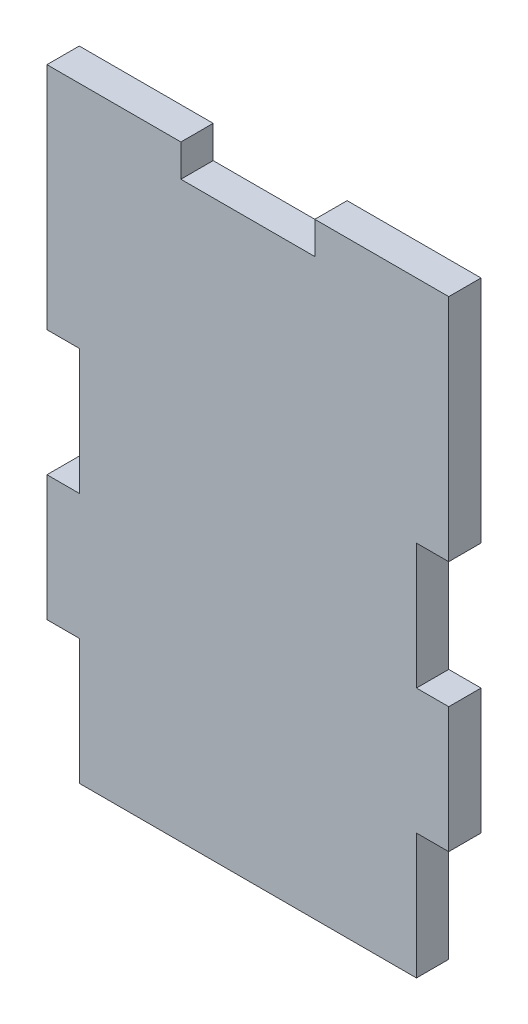
ISO-10303-21;
HEADER;
FILE_DESCRIPTION(('STEP AP214'),'2;1');
FILE_NAME('part.step','',(''),(''),'','','');
FILE_SCHEMA(('AUTOMOTIVE_DESIGN { 1 0 10303 214 1 1 1 1 }'));
ENDSEC;
DATA;
#1=APPLICATION_CONTEXT('core data for automotive mechanical design processes');
#2=APPLICATION_PROTOCOL_DEFINITION('international standard','automotive_design',2000,#1);
#3=PRODUCT_CONTEXT('',#1,'mechanical');
#4=PRODUCT('Part','Part','',(#3));
#5=PRODUCT_RELATED_PRODUCT_CATEGORY('part','',(#4));
#6=PRODUCT_DEFINITION_FORMATION('','',#4);
#7=PRODUCT_DEFINITION_CONTEXT('part definition',#1,'design');
#8=PRODUCT_DEFINITION('design','',#6,#7);
#9=PRODUCT_DEFINITION_SHAPE('','',#8);
#10=(LENGTH_UNIT() NAMED_UNIT(*) SI_UNIT(.MILLI.,.METRE.));
#11=(NAMED_UNIT(*) PLANE_ANGLE_UNIT() SI_UNIT($,.RADIAN.));
#12=(NAMED_UNIT(*) SI_UNIT($,.STERADIAN.) SOLID_ANGLE_UNIT());
#13=UNCERTAINTY_MEASURE_WITH_UNIT(LENGTH_MEASURE(1.E-05),#10,'distance_accuracy_value','');
#14=(GEOMETRIC_REPRESENTATION_CONTEXT(3) GLOBAL_UNCERTAINTY_ASSIGNED_CONTEXT((#13)) GLOBAL_UNIT_ASSIGNED_CONTEXT((#10,
#11,#12)) REPRESENTATION_CONTEXT('',''));
#15=CARTESIAN_POINT('',(0.,0.,0.));
#16=DIRECTION('',(0.,0.,1.));
#17=DIRECTION('',(1.,0.,0.));
#18=AXIS2_PLACEMENT_3D('',#15,#16,#17);
#19=CARTESIAN_POINT('',(0.,26.25,2.25));
#20=DIRECTION('',(0.,1.,0.));
#21=DIRECTION('',(0.,0.,1.));
#22=AXIS2_PLACEMENT_3D('',#19,#20,#21);
#23=PLANE('',#22);
#24=DIRECTION('',(1.,0.,0.));
#25=VECTOR('',#24,1.);
#26=CARTESIAN_POINT('',(0.,26.25,0.));
#27=LINE('',#26,#25);
#28=CARTESIAN_POINT('',(23.5,26.25,0.));
#29=VERTEX_POINT('',#28);
#30=CARTESIAN_POINT('',(25.75,26.25,0.));
#31=VERTEX_POINT('',#30);
#32=EDGE_CURVE('E206',#29,#31,#27,.T.);
#33=ORIENTED_EDGE('',*,*,#32,.T.);
#34=DIRECTION('',(0.,0.,-1.));
#35=VECTOR('',#34,1.);
#36=CARTESIAN_POINT('',(25.75,26.25,2.25));
#37=LINE('',#36,#35);
#38=CARTESIAN_POINT('',(25.75,26.25,2.25));
#39=VERTEX_POINT('',#38);
#40=EDGE_CURVE('E11',#39,#31,#37,.T.);
#41=ORIENTED_EDGE('',*,*,#40,.F.);
#42=DIRECTION('',(1.,0.,0.));
#43=VECTOR('',#42,1.);
#44=CARTESIAN_POINT('',(0.,26.25,2.25));
#45=LINE('',#44,#43);
#46=CARTESIAN_POINT('',(23.5,26.25,2.25));
#47=VERTEX_POINT('',#46);
#48=EDGE_CURVE('E347',#47,#39,#45,.T.);
#49=ORIENTED_EDGE('',*,*,#48,.F.);
#50=DIRECTION('',(0.,0.,-1.));
#51=VECTOR('',#50,1.);
#52=CARTESIAN_POINT('',(23.5,26.25,2.25));
#53=LINE('',#52,#51);
#54=EDGE_CURVE('E254',#47,#29,#53,.T.);
#55=ORIENTED_EDGE('',*,*,#54,.T.);
#56=EDGE_LOOP('',(#33,#41,#49,#55));
#57=FACE_BOUND('',#56,.T.);
#58=ADVANCED_FACE('F39',(#57),#23,.F.);
#59=CARTESIAN_POINT('',(25.7499999999999,0.,2.25));
#60=DIRECTION('',(-1.,0.,0.));
#61=DIRECTION('',(0.,-1.,0.));
#62=AXIS2_PLACEMENT_3D('',#59,#60,#61);
#63=PLANE('',#62);
#64=DIRECTION('',(0.,1.,0.));
#65=VECTOR('',#64,1.);
#66=CARTESIAN_POINT('',(25.7499999999999,0.,0.));
#67=LINE('',#66,#65);
#68=CARTESIAN_POINT('',(25.75,42.25,0.));
#69=VERTEX_POINT('',#68);
#70=EDGE_CURVE('E209',#31,#69,#67,.T.);
#71=ORIENTED_EDGE('',*,*,#70,.T.);
#72=DIRECTION('',(0.,0.,-1.));
#73=VECTOR('',#72,1.);
#74=CARTESIAN_POINT('',(25.75,42.25,2.25));
#75=LINE('',#74,#73);
#76=CARTESIAN_POINT('',(25.75,42.25,2.25));
#77=VERTEX_POINT('',#76);
#78=EDGE_CURVE('E47',#77,#69,#75,.T.);
#79=ORIENTED_EDGE('',*,*,#78,.F.);
#80=DIRECTION('',(0.,1.,0.));
#81=VECTOR('',#80,1.);
#82=CARTESIAN_POINT('',(25.7499999999999,0.,2.25));
#83=LINE('',#82,#81);
#84=EDGE_CURVE('E133',#39,#77,#83,.T.);
#85=ORIENTED_EDGE('',*,*,#84,.F.);
#86=ORIENTED_EDGE('',*,*,#40,.T.);
#87=EDGE_LOOP('',(#71,#79,#85,#86));
#88=FACE_BOUND('',#87,.T.);
#89=ADVANCED_FACE('F352',(#88),#63,.F.);
#90=CARTESIAN_POINT('',(0.,42.25,2.25));
#91=DIRECTION('',(0.,-1.,0.));
#92=DIRECTION('',(0.,0.,-1.));
#93=AXIS2_PLACEMENT_3D('',#90,#91,#92);
#94=PLANE('',#93);
#95=DIRECTION('',(-1.,0.,0.));
#96=VECTOR('',#95,1.);
#97=CARTESIAN_POINT('',(0.,42.25,0.));
#98=LINE('',#97,#96);
#99=CARTESIAN_POINT('',(16.4166666666667,42.25,0.));
#100=VERTEX_POINT('',#99);
#101=EDGE_CURVE('E211',#69,#100,#98,.T.);
#102=ORIENTED_EDGE('',*,*,#101,.T.);
#103=DIRECTION('',(0.,0.,-1.));
#104=VECTOR('',#103,1.);
#105=CARTESIAN_POINT('',(16.4166666666667,42.25,2.25));
#106=LINE('',#105,#104);
#107=CARTESIAN_POINT('',(16.4166666666667,42.25,2.25));
#108=VERTEX_POINT('',#107);
#109=EDGE_CURVE('E286',#108,#100,#106,.T.);
#110=ORIENTED_EDGE('',*,*,#109,.F.);
#111=DIRECTION('',(-1.,0.,0.));
#112=VECTOR('',#111,1.);
#113=CARTESIAN_POINT('',(0.,42.25,2.25));
#114=LINE('',#113,#112);
#115=EDGE_CURVE('E293',#77,#108,#114,.T.);
#116=ORIENTED_EDGE('',*,*,#115,.F.);
#117=ORIENTED_EDGE('',*,*,#78,.T.);
#118=EDGE_LOOP('',(#102,#110,#116,#117));
#119=FACE_BOUND('',#118,.T.);
#120=ADVANCED_FACE('F291',(#119),#94,.F.);
#121=CARTESIAN_POINT('',(16.4166666666667,0.,2.25));
#122=DIRECTION('',(-1.,0.,0.));
#123=DIRECTION('',(0.,0.,1.));
#124=AXIS2_PLACEMENT_3D('',#121,#122,#123);
#125=PLANE('',#124);
#126=DIRECTION('',(0.,1.,0.));
#127=VECTOR('',#126,1.);
#128=CARTESIAN_POINT('',(16.4166666666667,0.,0.));
#129=LINE('',#128,#127);
#130=CARTESIAN_POINT('',(16.4166666666667,40.,0.));
#131=VERTEX_POINT('',#130);
#132=EDGE_CURVE('E214',#131,#100,#129,.T.);
#133=ORIENTED_EDGE('',*,*,#132,.F.);
#134=DIRECTION('',(0.,0.,-1.));
#135=VECTOR('',#134,1.);
#136=CARTESIAN_POINT('',(16.4166666666667,40.,2.25));
#137=LINE('',#136,#135);
#138=CARTESIAN_POINT('',(16.4166666666667,40.,2.25));
#139=VERTEX_POINT('',#138);
#140=EDGE_CURVE('E284',#139,#131,#137,.T.);
#141=ORIENTED_EDGE('',*,*,#140,.F.);
#142=DIRECTION('',(0.,1.,0.));
#143=VECTOR('',#142,1.);
#144=CARTESIAN_POINT('',(16.4166666666667,0.,2.25));
#145=LINE('',#144,#143);
#146=EDGE_CURVE('E304',#139,#108,#145,.T.);
#147=ORIENTED_EDGE('',*,*,#146,.T.);
#148=ORIENTED_EDGE('',*,*,#109,.T.);
#149=EDGE_LOOP('',(#133,#141,#147,#148));
#150=FACE_BOUND('',#149,.T.);
#151=ADVANCED_FACE('F301',(#150),#125,.T.);
#152=CARTESIAN_POINT('',(0.,40.,2.25));
#153=DIRECTION('',(0.,1.,0.));
#154=DIRECTION('',(0.,0.,1.));
#155=AXIS2_PLACEMENT_3D('',#152,#153,#154);
#156=PLANE('',#155);
#157=DIRECTION('',(1.,0.,0.));
#158=VECTOR('',#157,1.);
#159=CARTESIAN_POINT('',(0.,40.,0.));
#160=LINE('',#159,#158);
#161=CARTESIAN_POINT('',(7.08333333333333,40.,0.));
#162=VERTEX_POINT('',#161);
#163=EDGE_CURVE('E217',#162,#131,#160,.T.);
#164=ORIENTED_EDGE('',*,*,#163,.F.);
#165=DIRECTION('',(0.,0.,-1.));
#166=VECTOR('',#165,1.);
#167=CARTESIAN_POINT('',(7.08333333333333,40.,2.25));
#168=LINE('',#167,#166);
#169=CARTESIAN_POINT('',(7.08333333333333,40.,2.25));
#170=VERTEX_POINT('',#169);
#171=EDGE_CURVE('E282',#170,#162,#168,.T.);
#172=ORIENTED_EDGE('',*,*,#171,.F.);
#173=DIRECTION('',(1.,0.,0.));
#174=VECTOR('',#173,1.);
#175=CARTESIAN_POINT('',(0.,40.,2.25));
#176=LINE('',#175,#174);
#177=EDGE_CURVE('E307',#170,#139,#176,.T.);
#178=ORIENTED_EDGE('',*,*,#177,.T.);
#179=ORIENTED_EDGE('',*,*,#140,.T.);
#180=EDGE_LOOP('',(#164,#172,#178,#179));
#181=FACE_BOUND('',#180,.T.);
#182=ADVANCED_FACE('F362',(#181),#156,.T.);
#183=CARTESIAN_POINT('',(7.08333333333331,0.,2.25));
#184=DIRECTION('',(-1.,0.,0.));
#185=DIRECTION('',(0.,-1.,0.));
#186=AXIS2_PLACEMENT_3D('',#183,#184,#185);
#187=PLANE('',#186);
#188=DIRECTION('',(0.,1.,0.));
#189=VECTOR('',#188,1.);
#190=CARTESIAN_POINT('',(7.08333333333331,0.,0.));
#191=LINE('',#190,#189);
#192=CARTESIAN_POINT('',(7.08333333333333,42.25,0.));
#193=VERTEX_POINT('',#192);
#194=EDGE_CURVE('E220',#162,#193,#191,.T.);
#195=ORIENTED_EDGE('',*,*,#194,.T.);
#196=DIRECTION('',(0.,0.,-1.));
#197=VECTOR('',#196,1.);
#198=CARTESIAN_POINT('',(7.08333333333333,42.25,2.25));
#199=LINE('',#198,#197);
#200=CARTESIAN_POINT('',(7.08333333333333,42.25,2.25));
#201=VERTEX_POINT('',#200);
#202=EDGE_CURVE('E280',#201,#193,#199,.T.);
#203=ORIENTED_EDGE('',*,*,#202,.F.);
#204=DIRECTION('',(0.,1.,0.));
#205=VECTOR('',#204,1.);
#206=CARTESIAN_POINT('',(7.08333333333331,0.,2.25));
#207=LINE('',#206,#205);
#208=EDGE_CURVE('E309',#170,#201,#207,.T.);
#209=ORIENTED_EDGE('',*,*,#208,.F.);
#210=ORIENTED_EDGE('',*,*,#171,.T.);
#211=EDGE_LOOP('',(#195,#203,#209,#210));
#212=FACE_BOUND('',#211,.T.);
#213=ADVANCED_FACE('F365',(#212),#187,.F.);
#214=CARTESIAN_POINT('',(0.,42.25,2.25));
#215=DIRECTION('',(0.,1.,0.));
#216=DIRECTION('',(0.,0.,1.));
#217=AXIS2_PLACEMENT_3D('',#214,#215,#216);
#218=PLANE('',#217);
#219=DIRECTION('',(1.,0.,0.));
#220=VECTOR('',#219,1.);
#221=CARTESIAN_POINT('',(0.,42.25,0.));
#222=LINE('',#221,#220);
#223=CARTESIAN_POINT('',(-2.25,42.25,0.));
#224=VERTEX_POINT('',#223);
#225=EDGE_CURVE('E223',#224,#193,#222,.T.);
#226=ORIENTED_EDGE('',*,*,#225,.F.);
#227=DIRECTION('',(0.,0.,-1.));
#228=VECTOR('',#227,1.);
#229=CARTESIAN_POINT('',(-2.25,42.25,2.25));
#230=LINE('',#229,#228);
#231=CARTESIAN_POINT('',(-2.25,42.25,2.25));
#232=VERTEX_POINT('',#231);
#233=EDGE_CURVE('E278',#232,#224,#230,.T.);
#234=ORIENTED_EDGE('',*,*,#233,.F.);
#235=DIRECTION('',(1.,0.,0.));
#236=VECTOR('',#235,1.);
#237=CARTESIAN_POINT('',(0.,42.25,2.25));
#238=LINE('',#237,#236);
#239=EDGE_CURVE('E315',#232,#201,#238,.T.);
#240=ORIENTED_EDGE('',*,*,#239,.T.);
#241=ORIENTED_EDGE('',*,*,#202,.T.);
#242=EDGE_LOOP('',(#226,#234,#240,#241));
#243=FACE_BOUND('',#242,.T.);
#244=ADVANCED_FACE('F369',(#243),#218,.T.);
#245=CARTESIAN_POINT('',(-2.24999999999995,0.,2.25));
#246=DIRECTION('',(-1.,0.,0.));
#247=DIRECTION('',(0.,-1.,0.));
#248=AXIS2_PLACEMENT_3D('',#245,#246,#247);
#249=PLANE('',#248);
#250=DIRECTION('',(0.,1.,0.));
#251=VECTOR('',#250,1.);
#252=CARTESIAN_POINT('',(-2.24999999999995,0.,0.));
#253=LINE('',#252,#251);
#254=CARTESIAN_POINT('',(-2.25,26.25,0.));
#255=VERTEX_POINT('',#254);
#256=EDGE_CURVE('E226',#255,#224,#253,.T.);
#257=ORIENTED_EDGE('',*,*,#256,.F.);
#258=DIRECTION('',(0.,0.,-1.));
#259=VECTOR('',#258,1.);
#260=CARTESIAN_POINT('',(-2.25,26.25,2.25));
#261=LINE('',#260,#259);
#262=CARTESIAN_POINT('',(-2.25,26.25,2.25));
#263=VERTEX_POINT('',#262);
#264=EDGE_CURVE('E276',#263,#255,#261,.T.);
#265=ORIENTED_EDGE('',*,*,#264,.F.);
#266=DIRECTION('',(0.,1.,0.));
#267=VECTOR('',#266,1.);
#268=CARTESIAN_POINT('',(-2.24999999999995,0.,2.25));
#269=LINE('',#268,#267);
#270=EDGE_CURVE('E318',#263,#232,#269,.T.);
#271=ORIENTED_EDGE('',*,*,#270,.T.);
#272=ORIENTED_EDGE('',*,*,#233,.T.);
#273=EDGE_LOOP('',(#257,#265,#271,#272));
#274=FACE_BOUND('',#273,.T.);
#275=ADVANCED_FACE('F373',(#274),#249,.T.);
#276=CARTESIAN_POINT('',(0.,26.25,2.25));
#277=DIRECTION('',(0.,-1.,0.));
#278=DIRECTION('',(0.,0.,-1.));
#279=AXIS2_PLACEMENT_3D('',#276,#277,#278);
#280=PLANE('',#279);
#281=DIRECTION('',(-1.,0.,0.));
#282=VECTOR('',#281,1.);
#283=CARTESIAN_POINT('',(0.,26.25,0.));
#284=LINE('',#283,#282);
#285=CARTESIAN_POINT('',(0.,26.25,0.));
#286=VERTEX_POINT('',#285);
#287=EDGE_CURVE('E229',#286,#255,#284,.T.);
#288=ORIENTED_EDGE('',*,*,#287,.F.);
#289=DIRECTION('',(0.,0.,-1.));
#290=VECTOR('',#289,1.);
#291=CARTESIAN_POINT('',(0.,26.25,2.25));
#292=LINE('',#291,#290);
#293=CARTESIAN_POINT('',(0.,26.25,2.25));
#294=VERTEX_POINT('',#293);
#295=EDGE_CURVE('E274',#294,#286,#292,.T.);
#296=ORIENTED_EDGE('',*,*,#295,.F.);
#297=DIRECTION('',(-1.,0.,0.));
#298=VECTOR('',#297,1.);
#299=CARTESIAN_POINT('',(0.,26.25,2.25));
#300=LINE('',#299,#298);
#301=EDGE_CURVE('E321',#294,#263,#300,.T.);
#302=ORIENTED_EDGE('',*,*,#301,.T.);
#303=ORIENTED_EDGE('',*,*,#264,.T.);
#304=EDGE_LOOP('',(#288,#296,#302,#303));
#305=FACE_BOUND('',#304,.T.);
#306=ADVANCED_FACE('F377',(#305),#280,.T.);
#307=CARTESIAN_POINT('',(0.,0.,2.25));
#308=DIRECTION('',(-1.,0.,0.));
#309=DIRECTION('',(0.,-1.,0.));
#310=AXIS2_PLACEMENT_3D('',#307,#308,#309);
#311=PLANE('',#310);
#312=DIRECTION('',(0.,1.,0.));
#313=VECTOR('',#312,1.);
#314=CARTESIAN_POINT('',(0.,0.,0.));
#315=LINE('',#314,#313);
#316=CARTESIAN_POINT('',(0.,17.5,0.));
#317=VERTEX_POINT('',#316);
#318=EDGE_CURVE('E232',#317,#286,#315,.T.);
#319=ORIENTED_EDGE('',*,*,#318,.F.);
#320=DIRECTION('',(0.,0.,-1.));
#321=VECTOR('',#320,1.);
#322=CARTESIAN_POINT('',(0.,17.5,2.25));
#323=LINE('',#322,#321);
#324=CARTESIAN_POINT('',(0.,17.5,2.25));
#325=VERTEX_POINT('',#324);
#326=EDGE_CURVE('E272',#325,#317,#323,.T.);
#327=ORIENTED_EDGE('',*,*,#326,.F.);
#328=DIRECTION('',(0.,1.,0.));
#329=VECTOR('',#328,1.);
#330=CARTESIAN_POINT('',(0.,0.,2.25));
#331=LINE('',#330,#329);
#332=EDGE_CURVE('E324',#325,#294,#331,.T.);
#333=ORIENTED_EDGE('',*,*,#332,.T.);
#334=ORIENTED_EDGE('',*,*,#295,.T.);
#335=EDGE_LOOP('',(#319,#327,#333,#334));
#336=FACE_BOUND('',#335,.T.);
#337=ADVANCED_FACE('F381',(#336),#311,.T.);
#338=CARTESIAN_POINT('',(0.,17.5,2.25));
#339=DIRECTION('',(0.,1.,0.));
#340=DIRECTION('',(-1.,0.,0.));
#341=AXIS2_PLACEMENT_3D('',#338,#339,#340);
#342=PLANE('',#341);
#343=DIRECTION('',(1.,0.,0.));
#344=VECTOR('',#343,1.);
#345=CARTESIAN_POINT('',(0.,17.5,0.));
#346=LINE('',#345,#344);
#347=CARTESIAN_POINT('',(-2.25000000000001,17.5,0.));
#348=VERTEX_POINT('',#347);
#349=EDGE_CURVE('E235',#348,#317,#346,.T.);
#350=ORIENTED_EDGE('',*,*,#349,.F.);
#351=DIRECTION('',(0.,0.,-1.));
#352=VECTOR('',#351,1.);
#353=CARTESIAN_POINT('',(-2.25000000000001,17.5,2.25));
#354=LINE('',#353,#352);
#355=CARTESIAN_POINT('',(-2.25000000000001,17.5,2.25));
#356=VERTEX_POINT('',#355);
#357=EDGE_CURVE('E270',#356,#348,#354,.T.);
#358=ORIENTED_EDGE('',*,*,#357,.F.);
#359=DIRECTION('',(1.,0.,0.));
#360=VECTOR('',#359,1.);
#361=CARTESIAN_POINT('',(0.,17.5,2.25));
#362=LINE('',#361,#360);
#363=EDGE_CURVE('E327',#356,#325,#362,.T.);
#364=ORIENTED_EDGE('',*,*,#363,.T.);
#365=ORIENTED_EDGE('',*,*,#326,.T.);
#366=EDGE_LOOP('',(#350,#358,#364,#365));
#367=FACE_BOUND('',#366,.T.);
#368=ADVANCED_FACE('F383',(#367),#342,.T.);
#369=CARTESIAN_POINT('',(-2.25000000000001,0.,2.25));
#370=DIRECTION('',(1.,0.,0.));
#371=DIRECTION('',(0.,0.,-1.));
#372=AXIS2_PLACEMENT_3D('',#369,#370,#371);
#373=PLANE('',#372);
#374=DIRECTION('',(0.,-1.,0.));
#375=VECTOR('',#374,1.);
#376=CARTESIAN_POINT('',(-2.25000000000001,0.,0.));
#377=LINE('',#376,#375);
#378=CARTESIAN_POINT('',(-2.25000000000001,8.75,0.));
#379=VERTEX_POINT('',#378);
#380=EDGE_CURVE('E239',#348,#379,#377,.T.);
#381=ORIENTED_EDGE('',*,*,#380,.T.);
#382=DIRECTION('',(0.,0.,-1.));
#383=VECTOR('',#382,1.);
#384=CARTESIAN_POINT('',(-2.25000000000001,8.75,2.25));
#385=LINE('',#384,#383);
#386=CARTESIAN_POINT('',(-2.25000000000001,8.75,2.25));
#387=VERTEX_POINT('',#386);
#388=EDGE_CURVE('E267',#387,#379,#385,.T.);
#389=ORIENTED_EDGE('',*,*,#388,.F.);
#390=DIRECTION('',(0.,-1.,0.));
#391=VECTOR('',#390,1.);
#392=CARTESIAN_POINT('',(-2.25000000000001,0.,2.25));
#393=LINE('',#392,#391);
#394=EDGE_CURVE('E331',#356,#387,#393,.T.);
#395=ORIENTED_EDGE('',*,*,#394,.F.);
#396=ORIENTED_EDGE('',*,*,#357,.T.);
#397=EDGE_LOOP('',(#381,#389,#395,#396));
#398=FACE_BOUND('',#397,.T.);
#399=ADVANCED_FACE('F386',(#398),#373,.F.);
#400=CARTESIAN_POINT('',(0.,8.75,2.25));
#401=DIRECTION('',(0.,1.,0.));
#402=DIRECTION('',(-1.,0.,0.));
#403=AXIS2_PLACEMENT_3D('',#400,#401,#402);
#404=PLANE('',#403);
#405=DIRECTION('',(1.,0.,0.));
#406=VECTOR('',#405,1.);
#407=CARTESIAN_POINT('',(0.,8.75,0.));
#408=LINE('',#407,#406);
#409=CARTESIAN_POINT('',(0.,8.75,0.));
#410=VERTEX_POINT('',#409);
#411=EDGE_CURVE('E241',#379,#410,#408,.T.);
#412=ORIENTED_EDGE('',*,*,#411,.T.);
#413=DIRECTION('',(0.,0.,-1.));
#414=VECTOR('',#413,1.);
#415=CARTESIAN_POINT('',(0.,8.75,2.25));
#416=LINE('',#415,#414);
#417=CARTESIAN_POINT('',(0.,8.75,2.25));
#418=VERTEX_POINT('',#417);
#419=EDGE_CURVE('E265',#418,#410,#416,.T.);
#420=ORIENTED_EDGE('',*,*,#419,.F.);
#421=DIRECTION('',(1.,0.,0.));
#422=VECTOR('',#421,1.);
#423=CARTESIAN_POINT('',(0.,8.75,2.25));
#424=LINE('',#423,#422);
#425=EDGE_CURVE('E333',#387,#418,#424,.T.);
#426=ORIENTED_EDGE('',*,*,#425,.F.);
#427=ORIENTED_EDGE('',*,*,#388,.T.);
#428=EDGE_LOOP('',(#412,#420,#426,#427));
#429=FACE_BOUND('',#428,.T.);
#430=ADVANCED_FACE('F390',(#429),#404,.F.);
#431=CARTESIAN_POINT('',(0.,0.,0.));
#432=VERTEX_POINT('',#431);
#433=EDGE_CURVE('E236',#432,#410,#315,.T.);
#434=ORIENTED_EDGE('',*,*,#433,.F.);
#435=DIRECTION('',(0.,0.,-1.));
#436=VECTOR('',#435,1.);
#437=CARTESIAN_POINT('',(0.,0.,2.25));
#438=LINE('',#437,#436);
#439=CARTESIAN_POINT('',(0.,0.,2.25));
#440=VERTEX_POINT('',#439);
#441=EDGE_CURVE('E263',#440,#432,#438,.T.);
#442=ORIENTED_EDGE('',*,*,#441,.F.);
#443=EDGE_CURVE('E328',#440,#418,#331,.T.);
#444=ORIENTED_EDGE('',*,*,#443,.T.);
#445=ORIENTED_EDGE('',*,*,#419,.T.);
#446=EDGE_LOOP('',(#434,#442,#444,#445));
#447=FACE_BOUND('',#446,.T.);
#448=ADVANCED_FACE('F394',(#447),#311,.T.);
#449=CARTESIAN_POINT('',(0.,0.,2.25));
#450=DIRECTION('',(0.,1.,0.));
#451=DIRECTION('',(0.,0.,1.));
#452=AXIS2_PLACEMENT_3D('',#449,#450,#451);
#453=PLANE('',#452);
#454=DIRECTION('',(1.,0.,0.));
#455=VECTOR('',#454,1.);
#456=CARTESIAN_POINT('',(0.,0.,0.));
#457=LINE('',#456,#455);
#458=CARTESIAN_POINT('',(23.5,0.,0.));
#459=VERTEX_POINT('',#458);
#460=EDGE_CURVE('E244',#432,#459,#457,.T.);
#461=ORIENTED_EDGE('',*,*,#460,.T.);
#462=DIRECTION('',(0.,0.,-1.));
#463=VECTOR('',#462,1.);
#464=CARTESIAN_POINT('',(23.5,0.,2.25));
#465=LINE('',#464,#463);
#466=CARTESIAN_POINT('',(23.5,0.,2.25));
#467=VERTEX_POINT('',#466);
#468=EDGE_CURVE('E260',#467,#459,#465,.T.);
#469=ORIENTED_EDGE('',*,*,#468,.F.);
#470=DIRECTION('',(1.,0.,0.));
#471=VECTOR('',#470,1.);
#472=CARTESIAN_POINT('',(0.,0.,2.25));
#473=LINE('',#472,#471);
#474=EDGE_CURVE('E335',#440,#467,#473,.T.);
#475=ORIENTED_EDGE('',*,*,#474,.F.);
#476=ORIENTED_EDGE('',*,*,#441,.T.);
#477=EDGE_LOOP('',(#461,#469,#475,#476));
#478=FACE_BOUND('',#477,.T.);
#479=ADVANCED_FACE('F398',(#478),#453,.F.);
#480=CARTESIAN_POINT('',(23.5,0.,2.25));
#481=DIRECTION('',(-1.,0.,0.));
#482=DIRECTION('',(0.,0.,1.));
#483=AXIS2_PLACEMENT_3D('',#480,#481,#482);
#484=PLANE('',#483);
#485=DIRECTION('',(0.,1.,0.));
#486=VECTOR('',#485,1.);
#487=CARTESIAN_POINT('',(23.5,0.,0.));
#488=LINE('',#487,#486);
#489=CARTESIAN_POINT('',(23.5,8.75,0.));
#490=VERTEX_POINT('',#489);
#491=EDGE_CURVE('E246',#459,#490,#488,.T.);
#492=ORIENTED_EDGE('',*,*,#491,.T.);
#493=DIRECTION('',(0.,0.,-1.));
#494=VECTOR('',#493,1.);
#495=CARTESIAN_POINT('',(23.5,8.75,2.25));
#496=LINE('',#495,#494);
#497=CARTESIAN_POINT('',(23.5,8.75,2.25));
#498=VERTEX_POINT('',#497);
#499=EDGE_CURVE('E258',#498,#490,#496,.T.);
#500=ORIENTED_EDGE('',*,*,#499,.F.);
#501=DIRECTION('',(0.,1.,0.));
#502=VECTOR('',#501,1.);
#503=CARTESIAN_POINT('',(23.5,0.,2.25));
#504=LINE('',#503,#502);
#505=EDGE_CURVE('E202',#467,#498,#504,.T.);
#506=ORIENTED_EDGE('',*,*,#505,.F.);
#507=ORIENTED_EDGE('',*,*,#468,.T.);
#508=EDGE_LOOP('',(#492,#500,#506,#507));
#509=FACE_BOUND('',#508,.T.);
#510=ADVANCED_FACE('F342',(#509),#484,.F.);
#511=CARTESIAN_POINT('',(0.,8.75,2.25));
#512=DIRECTION('',(0.,-1.,0.));
#513=DIRECTION('',(0.,0.,-1.));
#514=AXIS2_PLACEMENT_3D('',#511,#512,#513);
#515=PLANE('',#514);
#516=DIRECTION('',(-1.,0.,0.));
#517=VECTOR('',#516,1.);
#518=CARTESIAN_POINT('',(0.,8.75,0.));
#519=LINE('',#518,#517);
#520=CARTESIAN_POINT('',(25.75,8.75,0.));
#521=VERTEX_POINT('',#520);
#522=EDGE_CURVE('E249',#521,#490,#519,.T.);
#523=ORIENTED_EDGE('',*,*,#522,.F.);
#524=DIRECTION('',(0.,0.,-1.));
#525=VECTOR('',#524,1.);
#526=CARTESIAN_POINT('',(25.75,8.75,2.25));
#527=LINE('',#526,#525);
#528=CARTESIAN_POINT('',(25.75,8.75,2.25));
#529=VERTEX_POINT('',#528);
#530=EDGE_CURVE('E191',#529,#521,#527,.T.);
#531=ORIENTED_EDGE('',*,*,#530,.F.);
#532=DIRECTION('',(-1.,0.,0.));
#533=VECTOR('',#532,1.);
#534=CARTESIAN_POINT('',(0.,8.75,2.25));
#535=LINE('',#534,#533);
#536=EDGE_CURVE('E200',#529,#498,#535,.T.);
#537=ORIENTED_EDGE('',*,*,#536,.T.);
#538=ORIENTED_EDGE('',*,*,#499,.T.);
#539=EDGE_LOOP('',(#523,#531,#537,#538));
#540=FACE_BOUND('',#539,.T.);
#541=ADVANCED_FACE('F346',(#540),#515,.T.);
#542=CARTESIAN_POINT('',(25.75,0.,2.25));
#543=DIRECTION('',(1.,0.,0.));
#544=DIRECTION('',(0.,0.,-1.));
#545=AXIS2_PLACEMENT_3D('',#542,#543,#544);
#546=PLANE('',#545);
#547=DIRECTION('',(0.,-1.,0.));
#548=VECTOR('',#547,1.);
#549=CARTESIAN_POINT('',(25.75,0.,0.));
#550=LINE('',#549,#548);
#551=CARTESIAN_POINT('',(25.75,17.5,0.));
#552=VERTEX_POINT('',#551);
#553=EDGE_CURVE('E190',#552,#521,#550,.T.);
#554=ORIENTED_EDGE('',*,*,#553,.F.);
#555=DIRECTION('',(0.,0.,-1.));
#556=VECTOR('',#555,1.);
#557=CARTESIAN_POINT('',(25.75,17.5,2.25));
#558=LINE('',#557,#556);
#559=CARTESIAN_POINT('',(25.75,17.5,2.25));
#560=VERTEX_POINT('',#559);
#561=EDGE_CURVE('E184',#560,#552,#558,.T.);
#562=ORIENTED_EDGE('',*,*,#561,.F.);
#563=DIRECTION('',(0.,-1.,0.));
#564=VECTOR('',#563,1.);
#565=CARTESIAN_POINT('',(25.75,0.,2.25));
#566=LINE('',#565,#564);
#567=EDGE_CURVE('E188',#560,#529,#566,.T.);
#568=ORIENTED_EDGE('',*,*,#567,.T.);
#569=ORIENTED_EDGE('',*,*,#530,.T.);
#570=EDGE_LOOP('',(#554,#562,#568,#569));
#571=FACE_BOUND('',#570,.T.);
#572=ADVANCED_FACE('F186',(#571),#546,.T.);
#573=CARTESIAN_POINT('',(0.,17.5,2.25));
#574=DIRECTION('',(0.,-1.,0.));
#575=DIRECTION('',(0.,0.,-1.));
#576=AXIS2_PLACEMENT_3D('',#573,#574,#575);
#577=PLANE('',#576);
#578=DIRECTION('',(-1.,0.,0.));
#579=VECTOR('',#578,1.);
#580=CARTESIAN_POINT('',(0.,17.5,0.));
#581=LINE('',#580,#579);
#582=CARTESIAN_POINT('',(23.5,17.5,0.));
#583=VERTEX_POINT('',#582);
#584=EDGE_CURVE('E119',#552,#583,#581,.T.);
#585=ORIENTED_EDGE('',*,*,#584,.T.);
#586=DIRECTION('',(0.,0.,-1.));
#587=VECTOR('',#586,1.);
#588=CARTESIAN_POINT('',(23.5,17.5,2.25));
#589=LINE('',#588,#587);
#590=CARTESIAN_POINT('',(23.5,17.5,2.25));
#591=VERTEX_POINT('',#590);
#592=EDGE_CURVE('E192',#591,#583,#589,.T.);
#593=ORIENTED_EDGE('',*,*,#592,.F.);
#594=DIRECTION('',(-1.,0.,0.));
#595=VECTOR('',#594,1.);
#596=CARTESIAN_POINT('',(0.,17.5,2.25));
#597=LINE('',#596,#595);
#598=EDGE_CURVE('E194',#560,#591,#597,.T.);
#599=ORIENTED_EDGE('',*,*,#598,.F.);
#600=ORIENTED_EDGE('',*,*,#561,.T.);
#601=EDGE_LOOP('',(#585,#593,#599,#600));
#602=FACE_BOUND('',#601,.T.);
#603=ADVANCED_FACE('F195',(#602),#577,.F.);
#604=EDGE_CURVE('E125',#583,#29,#488,.T.);
#605=ORIENTED_EDGE('',*,*,#604,.T.);
#606=ORIENTED_EDGE('',*,*,#54,.F.);
#607=EDGE_CURVE('E55',#591,#47,#504,.T.);
#608=ORIENTED_EDGE('',*,*,#607,.F.);
#609=ORIENTED_EDGE('',*,*,#592,.T.);
#610=EDGE_LOOP('',(#605,#606,#608,#609));
#611=FACE_BOUND('',#610,.T.);
#612=ADVANCED_FACE('F409',(#611),#484,.F.);
#613=CARTESIAN_POINT('',(0.,0.,2.25));
#614=DIRECTION('',(0.,0.,1.));
#615=DIRECTION('',(1.,0.,0.));
#616=AXIS2_PLACEMENT_3D('',#613,#614,#615);
#617=PLANE('',#616);
#618=ORIENTED_EDGE('',*,*,#48,.T.);
#619=ORIENTED_EDGE('',*,*,#84,.T.);
#620=ORIENTED_EDGE('',*,*,#115,.T.);
#621=ORIENTED_EDGE('',*,*,#146,.F.);
#622=ORIENTED_EDGE('',*,*,#177,.F.);
#623=ORIENTED_EDGE('',*,*,#208,.T.);
#624=ORIENTED_EDGE('',*,*,#239,.F.);
#625=ORIENTED_EDGE('',*,*,#270,.F.);
#626=ORIENTED_EDGE('',*,*,#301,.F.);
#627=ORIENTED_EDGE('',*,*,#332,.F.);
#628=ORIENTED_EDGE('',*,*,#363,.F.);
#629=ORIENTED_EDGE('',*,*,#394,.T.);
#630=ORIENTED_EDGE('',*,*,#425,.T.);
#631=ORIENTED_EDGE('',*,*,#443,.F.);
#632=ORIENTED_EDGE('',*,*,#474,.T.);
#633=ORIENTED_EDGE('',*,*,#505,.T.);
#634=ORIENTED_EDGE('',*,*,#536,.F.);
#635=ORIENTED_EDGE('',*,*,#567,.F.);
#636=ORIENTED_EDGE('',*,*,#598,.T.);
#637=ORIENTED_EDGE('',*,*,#607,.T.);
#638=EDGE_LOOP('',(#618,#619,#620,#621,#622,#623,#624,#625,#626,#627,#628,#629,#630,#631,#632,
#633,#634,#635,#636,#637));
#639=FACE_BOUND('',#638,.T.);
#640=ADVANCED_FACE('F198',(#639),#617,.T.);
#641=CARTESIAN_POINT('',(0.,0.,0.));
#642=DIRECTION('',(0.,0.,1.));
#643=DIRECTION('',(1.,0.,0.));
#644=AXIS2_PLACEMENT_3D('',#641,#642,#643);
#645=PLANE('',#644);
#646=ORIENTED_EDGE('',*,*,#32,.F.);
#647=ORIENTED_EDGE('',*,*,#604,.F.);
#648=ORIENTED_EDGE('',*,*,#584,.F.);
#649=ORIENTED_EDGE('',*,*,#553,.T.);
#650=ORIENTED_EDGE('',*,*,#522,.T.);
#651=ORIENTED_EDGE('',*,*,#491,.F.);
#652=ORIENTED_EDGE('',*,*,#460,.F.);
#653=ORIENTED_EDGE('',*,*,#433,.T.);
#654=ORIENTED_EDGE('',*,*,#411,.F.);
#655=ORIENTED_EDGE('',*,*,#380,.F.);
#656=ORIENTED_EDGE('',*,*,#349,.T.);
#657=ORIENTED_EDGE('',*,*,#318,.T.);
#658=ORIENTED_EDGE('',*,*,#287,.T.);
#659=ORIENTED_EDGE('',*,*,#256,.T.);
#660=ORIENTED_EDGE('',*,*,#225,.T.);
#661=ORIENTED_EDGE('',*,*,#194,.F.);
#662=ORIENTED_EDGE('',*,*,#163,.T.);
#663=ORIENTED_EDGE('',*,*,#132,.T.);
#664=ORIENTED_EDGE('',*,*,#101,.F.);
#665=ORIENTED_EDGE('',*,*,#70,.F.);
#666=EDGE_LOOP('',(#646,#647,#648,#649,#650,#651,#652,#653,#654,#655,#656,#657,#658,#659,#660,
#661,#662,#663,#664,#665));
#667=FACE_BOUND('',#666,.T.);
#668=ADVANCED_FACE('F296',(#667),#645,.F.);
#669=CLOSED_SHELL('',(#58,#89,#120,#151,#182,#213,#244,#275,#306,#337,#368,#399,#430,#448,#479,
#510,#541,#572,#603,#612,#640,#668));
#670=MANIFOLD_SOLID_BREP('B2',#669);
#671=ADVANCED_BREP_SHAPE_REPRESENTATION('',(#18,#670),#14);
#672=SHAPE_DEFINITION_REPRESENTATION(#9,#671);
ENDSEC;
END-ISO-10303-21;
